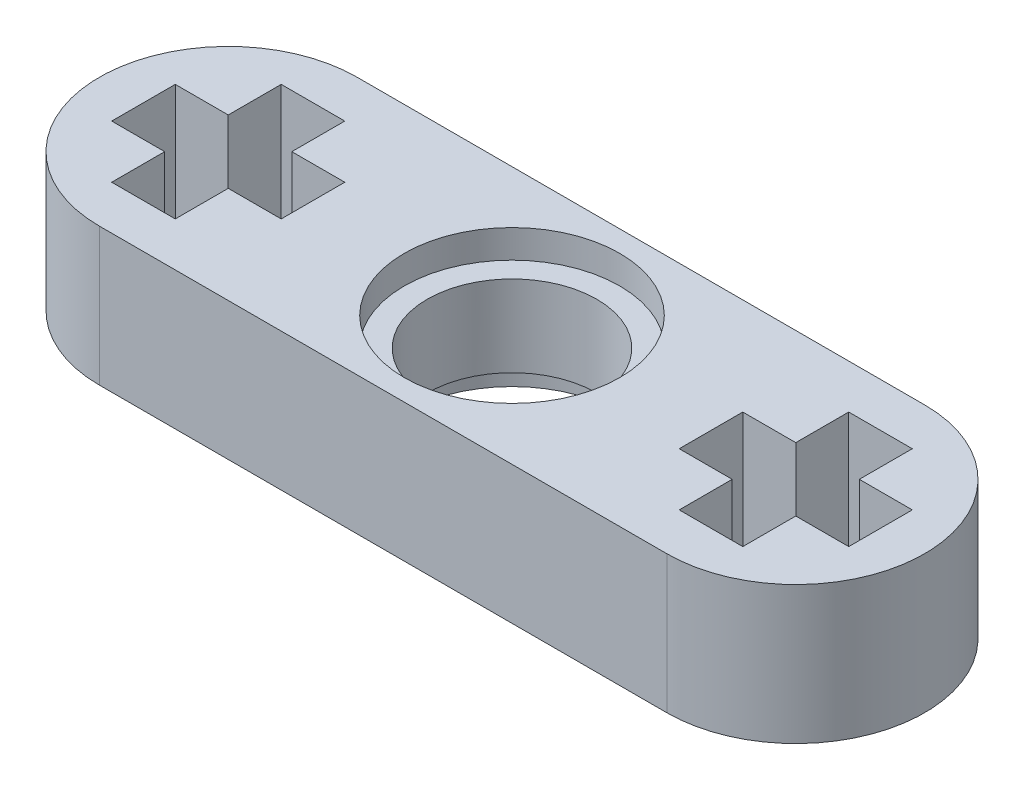
ISO-10303-21;
HEADER;
FILE_DESCRIPTION(('STEP AP214'),'2;1');
FILE_NAME('part.step','',(''),(''),'','','');
FILE_SCHEMA(('AUTOMOTIVE_DESIGN { 1 0 10303 214 1 1 1 1 }'));
ENDSEC;
DATA;
#1=APPLICATION_CONTEXT('core data for automotive mechanical design processes');
#2=APPLICATION_PROTOCOL_DEFINITION('international standard','automotive_design',2000,#1);
#3=PRODUCT_CONTEXT('',#1,'mechanical');
#4=PRODUCT('Part','Part','',(#3));
#5=PRODUCT_RELATED_PRODUCT_CATEGORY('part','',(#4));
#6=PRODUCT_DEFINITION_FORMATION('','',#4);
#7=PRODUCT_DEFINITION_CONTEXT('part definition',#1,'design');
#8=PRODUCT_DEFINITION('design','',#6,#7);
#9=PRODUCT_DEFINITION_SHAPE('','',#8);
#10=(LENGTH_UNIT() NAMED_UNIT(*) SI_UNIT(.MILLI.,.METRE.));
#11=(NAMED_UNIT(*) PLANE_ANGLE_UNIT() SI_UNIT($,.RADIAN.));
#12=(NAMED_UNIT(*) SI_UNIT($,.STERADIAN.) SOLID_ANGLE_UNIT());
#13=UNCERTAINTY_MEASURE_WITH_UNIT(LENGTH_MEASURE(1.E-05),#10,'distance_accuracy_value','');
#14=(GEOMETRIC_REPRESENTATION_CONTEXT(3) GLOBAL_UNCERTAINTY_ASSIGNED_CONTEXT((#13)) GLOBAL_UNIT_ASSIGNED_CONTEXT((#10,
#11,#12)) REPRESENTATION_CONTEXT('',''));
#15=CARTESIAN_POINT('',(0.,0.,0.));
#16=DIRECTION('',(0.,0.,1.));
#17=DIRECTION('',(1.,0.,0.));
#18=AXIS2_PLACEMENT_3D('',#15,#16,#17);
#19=CARTESIAN_POINT('',(0.,3.9,0.));
#20=DIRECTION('',(0.,-1.,0.));
#21=DIRECTION('',(0.,0.,-1.));
#22=AXIS2_PLACEMENT_3D('',#19,#20,#21);
#23=CYLINDRICAL_SURFACE('',#22,2.4);
#24=CARTESIAN_POINT('',(0.,3.1,0.));
#25=DIRECTION('',(0.,1.,0.));
#26=DIRECTION('',(0.,0.,1.));
#27=AXIS2_PLACEMENT_3D('',#24,#25,#26);
#28=CIRCLE('',#27,2.4);
#29=CARTESIAN_POINT('',(0.,3.1,2.4));
#30=VERTEX_POINT('',#29);
#31=EDGE_CURVE('E266',#30,#30,#28,.T.);
#32=ORIENTED_EDGE('',*,*,#31,.T.);
#33=EDGE_LOOP('',(#32));
#34=FACE_BOUND('',#33,.T.);
#35=CARTESIAN_POINT('',(0.,0.8,0.));
#36=DIRECTION('',(0.,-1.,0.));
#37=DIRECTION('',(0.,0.,-1.));
#38=AXIS2_PLACEMENT_3D('',#35,#36,#37);
#39=CIRCLE('',#38,2.4);
#40=CARTESIAN_POINT('',(0.,0.8,-2.4));
#41=VERTEX_POINT('',#40);
#42=EDGE_CURVE('E37',#41,#41,#39,.T.);
#43=ORIENTED_EDGE('',*,*,#42,.T.);
#44=EDGE_LOOP('',(#43));
#45=FACE_BOUND('',#44,.T.);
#46=ADVANCED_FACE('F33',(#34,#45),#23,.F.);
#47=CARTESIAN_POINT('',(-8.035,3.9,0.));
#48=DIRECTION('',(0.,1.,0.));
#49=DIRECTION('',(0.,0.,1.));
#50=AXIS2_PLACEMENT_3D('',#47,#48,#49);
#51=PLANE('',#50);
#52=CARTESIAN_POINT('',(0.,3.9,0.));
#53=DIRECTION('',(0.,1.,0.));
#54=DIRECTION('',(0.,0.,1.));
#55=AXIS2_PLACEMENT_3D('',#52,#53,#54);
#56=CIRCLE('',#55,3.05);
#57=CARTESIAN_POINT('',(0.,3.9,3.05));
#58=VERTEX_POINT('',#57);
#59=EDGE_CURVE('E432',#58,#58,#56,.T.);
#60=ORIENTED_EDGE('',*,*,#59,.F.);
#61=EDGE_LOOP('',(#60));
#62=FACE_BOUND('',#61,.T.);
#63=CARTESIAN_POINT('',(-8.035,3.9,0.));
#64=DIRECTION('',(0.,1.,0.));
#65=DIRECTION('',(0.,0.,1.));
#66=AXIS2_PLACEMENT_3D('',#63,#64,#65);
#67=CIRCLE('',#66,3.65);
#68=CARTESIAN_POINT('',(-8.035,3.9,-3.65));
#69=VERTEX_POINT('',#68);
#70=CARTESIAN_POINT('',(-8.035,3.9,3.65));
#71=VERTEX_POINT('',#70);
#72=EDGE_CURVE('E403',#69,#71,#67,.T.);
#73=ORIENTED_EDGE('',*,*,#72,.T.);
#74=DIRECTION('',(1.,0.,0.));
#75=VECTOR('',#74,1.);
#76=CARTESIAN_POINT('',(-8.035,3.9,3.65));
#77=LINE('',#76,#75);
#78=CARTESIAN_POINT('',(8.035,3.9,3.65));
#79=VERTEX_POINT('',#78);
#80=EDGE_CURVE('E406',#71,#79,#77,.T.);
#81=ORIENTED_EDGE('',*,*,#80,.T.);
#82=CARTESIAN_POINT('',(8.035,3.9,0.));
#83=DIRECTION('',(0.,1.,0.));
#84=DIRECTION('',(0.,0.,1.));
#85=AXIS2_PLACEMENT_3D('',#82,#83,#84);
#86=CIRCLE('',#85,3.65);
#87=CARTESIAN_POINT('',(8.035,3.9,-3.65));
#88=VERTEX_POINT('',#87);
#89=EDGE_CURVE('E409',#79,#88,#86,.T.);
#90=ORIENTED_EDGE('',*,*,#89,.T.);
#91=DIRECTION('',(-1.,0.,0.));
#92=VECTOR('',#91,1.);
#93=CARTESIAN_POINT('',(-8.035,3.9,-3.65));
#94=LINE('',#93,#92);
#95=EDGE_CURVE('E411',#88,#69,#94,.T.);
#96=ORIENTED_EDGE('',*,*,#95,.T.);
#97=EDGE_LOOP('',(#73,#81,#90,#96));
#98=FACE_BOUND('',#97,.T.);
#99=DIRECTION('',(1.,0.,0.));
#100=VECTOR('',#99,1.);
#101=CARTESIAN_POINT('',(10.435,3.9,0.899999999999998));
#102=LINE('',#101,#100);
#103=CARTESIAN_POINT('',(8.935,3.9,0.899999999999998));
#104=VERTEX_POINT('',#103);
#105=CARTESIAN_POINT('',(10.435,3.9,0.899999999999998));
#106=VERTEX_POINT('',#105);
#107=EDGE_CURVE('E318',#104,#106,#102,.T.);
#108=ORIENTED_EDGE('',*,*,#107,.F.);
#109=DIRECTION('',(0.,0.,-1.));
#110=VECTOR('',#109,1.);
#111=CARTESIAN_POINT('',(8.935,3.9,0.899999999999998));
#112=LINE('',#111,#110);
#113=CARTESIAN_POINT('',(8.935,3.9,2.4));
#114=VERTEX_POINT('',#113);
#115=EDGE_CURVE('E316',#114,#104,#112,.T.);
#116=ORIENTED_EDGE('',*,*,#115,.F.);
#117=DIRECTION('',(1.,0.,0.));
#118=VECTOR('',#117,1.);
#119=CARTESIAN_POINT('',(7.135,3.9,2.4));
#120=LINE('',#119,#118);
#121=CARTESIAN_POINT('',(7.135,3.9,2.4));
#122=VERTEX_POINT('',#121);
#123=EDGE_CURVE('E340',#122,#114,#120,.T.);
#124=ORIENTED_EDGE('',*,*,#123,.F.);
#125=DIRECTION('',(0.,0.,1.));
#126=VECTOR('',#125,1.);
#127=CARTESIAN_POINT('',(7.135,3.9,0.899999999999999));
#128=LINE('',#127,#126);
#129=CARTESIAN_POINT('',(7.135,3.9,0.899999999999999));
#130=VERTEX_POINT('',#129);
#131=EDGE_CURVE('E337',#130,#122,#128,.T.);
#132=ORIENTED_EDGE('',*,*,#131,.F.);
#133=DIRECTION('',(1.,0.,0.));
#134=VECTOR('',#133,1.);
#135=CARTESIAN_POINT('',(7.135,3.9,0.899999999999999));
#136=LINE('',#135,#134);
#137=CARTESIAN_POINT('',(5.635,3.9,0.899999999999999));
#138=VERTEX_POINT('',#137);
#139=EDGE_CURVE('E335',#138,#130,#136,.T.);
#140=ORIENTED_EDGE('',*,*,#139,.F.);
#141=DIRECTION('',(0.,0.,1.));
#142=VECTOR('',#141,1.);
#143=CARTESIAN_POINT('',(5.635,3.9,0.899999999999999));
#144=LINE('',#143,#142);
#145=CARTESIAN_POINT('',(5.63500000000001,3.9,-0.899999999999998));
#146=VERTEX_POINT('',#145);
#147=EDGE_CURVE('E333',#146,#138,#144,.T.);
#148=ORIENTED_EDGE('',*,*,#147,.F.);
#149=DIRECTION('',(-1.,0.,0.));
#150=VECTOR('',#149,1.);
#151=CARTESIAN_POINT('',(7.135,3.9,-0.899999999999999));
#152=LINE('',#151,#150);
#153=CARTESIAN_POINT('',(7.135,3.9,-0.899999999999999));
#154=VERTEX_POINT('',#153);
#155=EDGE_CURVE('E331',#154,#146,#152,.T.);
#156=ORIENTED_EDGE('',*,*,#155,.F.);
#157=DIRECTION('',(0.,0.,1.));
#158=VECTOR('',#157,1.);
#159=CARTESIAN_POINT('',(7.135,3.9,-2.4));
#160=LINE('',#159,#158);
#161=CARTESIAN_POINT('',(7.135,3.9,-2.4));
#162=VERTEX_POINT('',#161);
#163=EDGE_CURVE('E329',#162,#154,#160,.T.);
#164=ORIENTED_EDGE('',*,*,#163,.F.);
#165=DIRECTION('',(-1.,0.,0.));
#166=VECTOR('',#165,1.);
#167=CARTESIAN_POINT('',(7.135,3.9,-2.4));
#168=LINE('',#167,#166);
#169=CARTESIAN_POINT('',(8.935,3.9,-2.4));
#170=VERTEX_POINT('',#169);
#171=EDGE_CURVE('E327',#170,#162,#168,.T.);
#172=ORIENTED_EDGE('',*,*,#171,.F.);
#173=DIRECTION('',(0.,0.,-1.));
#174=VECTOR('',#173,1.);
#175=CARTESIAN_POINT('',(8.935,3.9,-2.4));
#176=LINE('',#175,#174);
#177=CARTESIAN_POINT('',(8.935,3.9,-0.900000000000001));
#178=VERTEX_POINT('',#177);
#179=EDGE_CURVE('E325',#178,#170,#176,.T.);
#180=ORIENTED_EDGE('',*,*,#179,.F.);
#181=DIRECTION('',(-1.,0.,0.));
#182=VECTOR('',#181,1.);
#183=CARTESIAN_POINT('',(10.435,3.9,-0.900000000000002));
#184=LINE('',#183,#182);
#185=CARTESIAN_POINT('',(10.435,3.9,-0.900000000000002));
#186=VERTEX_POINT('',#185);
#187=EDGE_CURVE('E323',#186,#178,#184,.T.);
#188=ORIENTED_EDGE('',*,*,#187,.F.);
#189=DIRECTION('',(0.,0.,-1.));
#190=VECTOR('',#189,1.);
#191=CARTESIAN_POINT('',(10.435,3.9,0.899999999999998));
#192=LINE('',#191,#190);
#193=EDGE_CURVE('E321',#106,#186,#192,.T.);
#194=ORIENTED_EDGE('',*,*,#193,.F.);
#195=EDGE_LOOP('',(#108,#116,#124,#132,#140,#148,#156,#164,#172,#180,#188,#194));
#196=FACE_BOUND('',#195,.T.);
#197=DIRECTION('',(1.,0.,0.));
#198=VECTOR('',#197,1.);
#199=CARTESIAN_POINT('',(-5.63495851707108,3.9,0.899893705918284));
#200=LINE('',#199,#198);
#201=CARTESIAN_POINT('',(-7.13495851707083,3.9,0.899893705918284));
#202=VERTEX_POINT('',#201);
#203=CARTESIAN_POINT('',(-5.63495851707108,3.9,0.899893705918284));
#204=VERTEX_POINT('',#203);
#205=EDGE_CURVE('E228',#202,#204,#200,.T.);
#206=ORIENTED_EDGE('',*,*,#205,.F.);
#207=DIRECTION('',(0.,0.,-1.));
#208=VECTOR('',#207,1.);
#209=CARTESIAN_POINT('',(-7.13495851707083,3.9,0.899893705918284));
#210=LINE('',#209,#208);
#211=CARTESIAN_POINT('',(-7.13495851707083,3.9,2.39989370592414));
#212=VERTEX_POINT('',#211);
#213=EDGE_CURVE('E220',#212,#202,#210,.T.);
#214=ORIENTED_EDGE('',*,*,#213,.F.);
#215=DIRECTION('',(1.,0.,0.));
#216=VECTOR('',#215,1.);
#217=CARTESIAN_POINT('',(-8.93495851707108,3.9,2.39989370592414));
#218=LINE('',#217,#216);
#219=CARTESIAN_POINT('',(-8.93495851707108,3.9,2.39989370592414));
#220=VERTEX_POINT('',#219);
#221=EDGE_CURVE('E263',#220,#212,#218,.T.);
#222=ORIENTED_EDGE('',*,*,#221,.F.);
#223=DIRECTION('',(0.,0.,1.));
#224=VECTOR('',#223,1.);
#225=CARTESIAN_POINT('',(-8.93495851707108,3.9,0.899893705918285));
#226=LINE('',#225,#224);
#227=CARTESIAN_POINT('',(-8.93495851707108,3.9,0.899893705918285));
#228=VERTEX_POINT('',#227);
#229=EDGE_CURVE('E261',#228,#220,#226,.T.);
#230=ORIENTED_EDGE('',*,*,#229,.F.);
#231=DIRECTION('',(1.,0.,0.));
#232=VECTOR('',#231,1.);
#233=CARTESIAN_POINT('',(-8.93495851707108,3.9,0.899893705918285));
#234=LINE('',#233,#232);
#235=CARTESIAN_POINT('',(-10.4349585170711,3.9,0.899893705918285));
#236=VERTEX_POINT('',#235);
#237=EDGE_CURVE('E259',#236,#228,#234,.T.);
#238=ORIENTED_EDGE('',*,*,#237,.F.);
#239=DIRECTION('',(0.,0.,1.));
#240=VECTOR('',#239,1.);
#241=CARTESIAN_POINT('',(-10.4349585170711,3.9,0.899893705918285));
#242=LINE('',#241,#240);
#243=CARTESIAN_POINT('',(-10.4349585170711,3.9,-0.900106294081966));
#244=VERTEX_POINT('',#243);
#245=EDGE_CURVE('E257',#244,#236,#242,.T.);
#246=ORIENTED_EDGE('',*,*,#245,.F.);
#247=DIRECTION('',(-1.,0.,0.));
#248=VECTOR('',#247,1.);
#249=CARTESIAN_POINT('',(-8.93495851707108,3.9,-0.900106294081967));
#250=LINE('',#249,#248);
#251=CARTESIAN_POINT('',(-8.93495851707108,3.9,-0.900106294081967));
#252=VERTEX_POINT('',#251);
#253=EDGE_CURVE('E255',#252,#244,#250,.T.);
#254=ORIENTED_EDGE('',*,*,#253,.F.);
#255=DIRECTION('',(0.,0.,1.));
#256=VECTOR('',#255,1.);
#257=CARTESIAN_POINT('',(-8.93495851707108,3.9,-2.40010629407583));
#258=LINE('',#257,#256);
#259=CARTESIAN_POINT('',(-8.93495851707108,3.9,-2.40010629407583));
#260=VERTEX_POINT('',#259);
#261=EDGE_CURVE('E253',#260,#252,#258,.T.);
#262=ORIENTED_EDGE('',*,*,#261,.F.);
#263=DIRECTION('',(-1.,0.,0.));
#264=VECTOR('',#263,1.);
#265=CARTESIAN_POINT('',(-8.93495851707108,3.9,-2.40010629407583));
#266=LINE('',#265,#264);
#267=CARTESIAN_POINT('',(-7.13495851707083,3.9,-2.40010629407583));
#268=VERTEX_POINT('',#267);
#269=EDGE_CURVE('E251',#268,#260,#266,.T.);
#270=ORIENTED_EDGE('',*,*,#269,.F.);
#271=DIRECTION('',(0.,0.,-1.));
#272=VECTOR('',#271,1.);
#273=CARTESIAN_POINT('',(-7.13495851707083,3.9,-2.40010629407583));
#274=LINE('',#273,#272);
#275=CARTESIAN_POINT('',(-7.13495851707083,3.9,-0.900106294081968));
#276=VERTEX_POINT('',#275);
#277=EDGE_CURVE('E249',#276,#268,#274,.T.);
#278=ORIENTED_EDGE('',*,*,#277,.F.);
#279=DIRECTION('',(-1.,0.,0.));
#280=VECTOR('',#279,1.);
#281=CARTESIAN_POINT('',(-5.63495851707109,3.9,-0.900106294081967));
#282=LINE('',#281,#280);
#283=CARTESIAN_POINT('',(-5.63495851707109,3.9,-0.900106294081967));
#284=VERTEX_POINT('',#283);
#285=EDGE_CURVE('E244',#284,#276,#282,.T.);
#286=ORIENTED_EDGE('',*,*,#285,.F.);
#287=DIRECTION('',(0.,0.,-1.));
#288=VECTOR('',#287,1.);
#289=CARTESIAN_POINT('',(-5.63495851707108,3.9,0.899893705918284));
#290=LINE('',#289,#288);
#291=EDGE_CURVE('E242',#204,#284,#290,.T.);
#292=ORIENTED_EDGE('',*,*,#291,.F.);
#293=EDGE_LOOP('',(#206,#214,#222,#230,#238,#246,#254,#262,#270,#278,#286,#292));
#294=FACE_BOUND('',#293,.T.);
#295=ADVANCED_FACE('F240',(#62,#98,#196,#294),#51,.T.);
#296=CARTESIAN_POINT('',(-8.035,0.,0.));
#297=DIRECTION('',(0.,1.,0.));
#298=DIRECTION('',(0.,0.,1.));
#299=AXIS2_PLACEMENT_3D('',#296,#297,#298);
#300=PLANE('',#299);
#301=CARTESIAN_POINT('',(0.,0.,0.));
#302=DIRECTION('',(0.,-1.,0.));
#303=DIRECTION('',(0.,0.,-1.));
#304=AXIS2_PLACEMENT_3D('',#301,#302,#303);
#305=CIRCLE('',#304,3.05);
#306=CARTESIAN_POINT('',(0.,0.,-3.05));
#307=VERTEX_POINT('',#306);
#308=EDGE_CURVE('E438',#307,#307,#305,.T.);
#309=ORIENTED_EDGE('',*,*,#308,.F.);
#310=EDGE_LOOP('',(#309));
#311=FACE_BOUND('',#310,.T.);
#312=DIRECTION('',(0.,0.,-1.));
#313=VECTOR('',#312,1.);
#314=CARTESIAN_POINT('',(8.935,0.,0.899999999999998));
#315=LINE('',#314,#313);
#316=CARTESIAN_POINT('',(8.935,0.,2.4));
#317=VERTEX_POINT('',#316);
#318=CARTESIAN_POINT('',(8.935,0.,0.899999999999998));
#319=VERTEX_POINT('',#318);
#320=EDGE_CURVE('E236',#317,#319,#315,.T.);
#321=ORIENTED_EDGE('',*,*,#320,.T.);
#322=DIRECTION('',(1.,0.,0.));
#323=VECTOR('',#322,1.);
#324=CARTESIAN_POINT('',(10.435,0.,0.899999999999998));
#325=LINE('',#324,#323);
#326=CARTESIAN_POINT('',(10.435,0.,0.899999999999998));
#327=VERTEX_POINT('',#326);
#328=EDGE_CURVE('E345',#319,#327,#325,.T.);
#329=ORIENTED_EDGE('',*,*,#328,.T.);
#330=DIRECTION('',(0.,0.,-1.));
#331=VECTOR('',#330,1.);
#332=CARTESIAN_POINT('',(10.435,0.,0.899999999999998));
#333=LINE('',#332,#331);
#334=CARTESIAN_POINT('',(10.435,0.,-0.900000000000002));
#335=VERTEX_POINT('',#334);
#336=EDGE_CURVE('E348',#327,#335,#333,.T.);
#337=ORIENTED_EDGE('',*,*,#336,.T.);
#338=DIRECTION('',(-1.,0.,0.));
#339=VECTOR('',#338,1.);
#340=CARTESIAN_POINT('',(10.435,0.,-0.900000000000002));
#341=LINE('',#340,#339);
#342=CARTESIAN_POINT('',(8.935,0.,-0.900000000000001));
#343=VERTEX_POINT('',#342);
#344=EDGE_CURVE('E351',#335,#343,#341,.T.);
#345=ORIENTED_EDGE('',*,*,#344,.T.);
#346=DIRECTION('',(0.,0.,-1.));
#347=VECTOR('',#346,1.);
#348=CARTESIAN_POINT('',(8.935,0.,-2.4));
#349=LINE('',#348,#347);
#350=CARTESIAN_POINT('',(8.935,0.,-2.4));
#351=VERTEX_POINT('',#350);
#352=EDGE_CURVE('E354',#343,#351,#349,.T.);
#353=ORIENTED_EDGE('',*,*,#352,.T.);
#354=DIRECTION('',(-1.,0.,0.));
#355=VECTOR('',#354,1.);
#356=CARTESIAN_POINT('',(7.135,0.,-2.4));
#357=LINE('',#356,#355);
#358=CARTESIAN_POINT('',(7.135,0.,-2.4));
#359=VERTEX_POINT('',#358);
#360=EDGE_CURVE('E357',#351,#359,#357,.T.);
#361=ORIENTED_EDGE('',*,*,#360,.T.);
#362=DIRECTION('',(0.,0.,1.));
#363=VECTOR('',#362,1.);
#364=CARTESIAN_POINT('',(7.135,0.,-2.4));
#365=LINE('',#364,#363);
#366=CARTESIAN_POINT('',(7.135,0.,-0.899999999999999));
#367=VERTEX_POINT('',#366);
#368=EDGE_CURVE('E360',#359,#367,#365,.T.);
#369=ORIENTED_EDGE('',*,*,#368,.T.);
#370=DIRECTION('',(-1.,0.,0.));
#371=VECTOR('',#370,1.);
#372=CARTESIAN_POINT('',(7.135,0.,-0.899999999999999));
#373=LINE('',#372,#371);
#374=CARTESIAN_POINT('',(5.63500000000001,0.,-0.899999999999998));
#375=VERTEX_POINT('',#374);
#376=EDGE_CURVE('E363',#367,#375,#373,.T.);
#377=ORIENTED_EDGE('',*,*,#376,.T.);
#378=DIRECTION('',(0.,0.,1.));
#379=VECTOR('',#378,1.);
#380=CARTESIAN_POINT('',(5.635,0.,0.899999999999999));
#381=LINE('',#380,#379);
#382=CARTESIAN_POINT('',(5.635,0.,0.899999999999999));
#383=VERTEX_POINT('',#382);
#384=EDGE_CURVE('E366',#375,#383,#381,.T.);
#385=ORIENTED_EDGE('',*,*,#384,.T.);
#386=DIRECTION('',(1.,0.,0.));
#387=VECTOR('',#386,1.);
#388=CARTESIAN_POINT('',(7.135,0.,0.899999999999999));
#389=LINE('',#388,#387);
#390=CARTESIAN_POINT('',(7.135,0.,0.899999999999999));
#391=VERTEX_POINT('',#390);
#392=EDGE_CURVE('E369',#383,#391,#389,.T.);
#393=ORIENTED_EDGE('',*,*,#392,.T.);
#394=DIRECTION('',(0.,0.,1.));
#395=VECTOR('',#394,1.);
#396=CARTESIAN_POINT('',(7.135,0.,0.899999999999999));
#397=LINE('',#396,#395);
#398=CARTESIAN_POINT('',(7.135,0.,2.4));
#399=VERTEX_POINT('',#398);
#400=EDGE_CURVE('E372',#391,#399,#397,.T.);
#401=ORIENTED_EDGE('',*,*,#400,.T.);
#402=DIRECTION('',(1.,0.,0.));
#403=VECTOR('',#402,1.);
#404=CARTESIAN_POINT('',(7.135,0.,2.4));
#405=LINE('',#404,#403);
#406=EDGE_CURVE('E319',#399,#317,#405,.T.);
#407=ORIENTED_EDGE('',*,*,#406,.T.);
#408=EDGE_LOOP('',(#321,#329,#337,#345,#353,#361,#369,#377,#385,#393,#401,#407));
#409=FACE_BOUND('',#408,.T.);
#410=CARTESIAN_POINT('',(-8.035,0.,0.));
#411=DIRECTION('',(0.,1.,0.));
#412=DIRECTION('',(0.,0.,1.));
#413=AXIS2_PLACEMENT_3D('',#410,#411,#412);
#414=CIRCLE('',#413,3.65);
#415=CARTESIAN_POINT('',(-8.035,0.,-3.65));
#416=VERTEX_POINT('',#415);
#417=CARTESIAN_POINT('',(-8.035,0.,3.65));
#418=VERTEX_POINT('',#417);
#419=EDGE_CURVE('E402',#416,#418,#414,.T.);
#420=ORIENTED_EDGE('',*,*,#419,.F.);
#421=DIRECTION('',(-1.,0.,0.));
#422=VECTOR('',#421,1.);
#423=CARTESIAN_POINT('',(-8.035,0.,-3.65));
#424=LINE('',#423,#422);
#425=CARTESIAN_POINT('',(8.035,0.,-3.65));
#426=VERTEX_POINT('',#425);
#427=EDGE_CURVE('E407',#426,#416,#424,.T.);
#428=ORIENTED_EDGE('',*,*,#427,.F.);
#429=CARTESIAN_POINT('',(8.035,0.,0.));
#430=DIRECTION('',(0.,1.,0.));
#431=DIRECTION('',(0.,0.,1.));
#432=AXIS2_PLACEMENT_3D('',#429,#430,#431);
#433=CIRCLE('',#432,3.65);
#434=CARTESIAN_POINT('',(8.035,0.,3.65));
#435=VERTEX_POINT('',#434);
#436=EDGE_CURVE('E418',#435,#426,#433,.T.);
#437=ORIENTED_EDGE('',*,*,#436,.F.);
#438=DIRECTION('',(1.,0.,0.));
#439=VECTOR('',#438,1.);
#440=CARTESIAN_POINT('',(-8.035,0.,3.65));
#441=LINE('',#440,#439);
#442=EDGE_CURVE('E416',#418,#435,#441,.T.);
#443=ORIENTED_EDGE('',*,*,#442,.F.);
#444=EDGE_LOOP('',(#420,#428,#437,#443));
#445=FACE_BOUND('',#444,.T.);
#446=DIRECTION('',(0.,0.,-1.));
#447=VECTOR('',#446,1.);
#448=CARTESIAN_POINT('',(-7.13495851707083,0.,0.899893705918284));
#449=LINE('',#448,#447);
#450=CARTESIAN_POINT('',(-7.13495851707083,0.,2.39989370592414));
#451=VERTEX_POINT('',#450);
#452=CARTESIAN_POINT('',(-7.13495851707083,0.,0.899893705918284));
#453=VERTEX_POINT('',#452);
#454=EDGE_CURVE('E58',#451,#453,#449,.T.);
#455=ORIENTED_EDGE('',*,*,#454,.T.);
#456=DIRECTION('',(1.,0.,0.));
#457=VECTOR('',#456,1.);
#458=CARTESIAN_POINT('',(-5.63495851707108,0.,0.899893705918284));
#459=LINE('',#458,#457);
#460=CARTESIAN_POINT('',(-5.63495851707108,0.,0.899893705918284));
#461=VERTEX_POINT('',#460);
#462=EDGE_CURVE('E235',#453,#461,#459,.T.);
#463=ORIENTED_EDGE('',*,*,#462,.T.);
#464=DIRECTION('',(0.,0.,-1.));
#465=VECTOR('',#464,1.);
#466=CARTESIAN_POINT('',(-5.63495851707108,0.,0.899893705918284));
#467=LINE('',#466,#465);
#468=CARTESIAN_POINT('',(-5.63495851707109,0.,-0.900106294081967));
#469=VERTEX_POINT('',#468);
#470=EDGE_CURVE('E268',#461,#469,#467,.T.);
#471=ORIENTED_EDGE('',*,*,#470,.T.);
#472=DIRECTION('',(-1.,0.,0.));
#473=VECTOR('',#472,1.);
#474=CARTESIAN_POINT('',(-5.63495851707109,0.,-0.900106294081967));
#475=LINE('',#474,#473);
#476=CARTESIAN_POINT('',(-7.13495851707083,0.,-0.900106294081968));
#477=VERTEX_POINT('',#476);
#478=EDGE_CURVE('E271',#469,#477,#475,.T.);
#479=ORIENTED_EDGE('',*,*,#478,.T.);
#480=DIRECTION('',(0.,0.,-1.));
#481=VECTOR('',#480,1.);
#482=CARTESIAN_POINT('',(-7.13495851707083,0.,-2.40010629407583));
#483=LINE('',#482,#481);
#484=CARTESIAN_POINT('',(-7.13495851707083,0.,-2.40010629407583));
#485=VERTEX_POINT('',#484);
#486=EDGE_CURVE('E274',#477,#485,#483,.T.);
#487=ORIENTED_EDGE('',*,*,#486,.T.);
#488=DIRECTION('',(-1.,0.,0.));
#489=VECTOR('',#488,1.);
#490=CARTESIAN_POINT('',(-8.93495851707108,0.,-2.40010629407583));
#491=LINE('',#490,#489);
#492=CARTESIAN_POINT('',(-8.93495851707108,0.,-2.40010629407583));
#493=VERTEX_POINT('',#492);
#494=EDGE_CURVE('E277',#485,#493,#491,.T.);
#495=ORIENTED_EDGE('',*,*,#494,.T.);
#496=DIRECTION('',(0.,0.,1.));
#497=VECTOR('',#496,1.);
#498=CARTESIAN_POINT('',(-8.93495851707108,0.,-2.40010629407583));
#499=LINE('',#498,#497);
#500=CARTESIAN_POINT('',(-8.93495851707108,0.,-0.900106294081967));
#501=VERTEX_POINT('',#500);
#502=EDGE_CURVE('E280',#493,#501,#499,.T.);
#503=ORIENTED_EDGE('',*,*,#502,.T.);
#504=DIRECTION('',(-1.,0.,0.));
#505=VECTOR('',#504,1.);
#506=CARTESIAN_POINT('',(-8.93495851707108,0.,-0.900106294081967));
#507=LINE('',#506,#505);
#508=CARTESIAN_POINT('',(-10.4349585170711,0.,-0.900106294081966));
#509=VERTEX_POINT('',#508);
#510=EDGE_CURVE('E283',#501,#509,#507,.T.);
#511=ORIENTED_EDGE('',*,*,#510,.T.);
#512=DIRECTION('',(0.,0.,1.));
#513=VECTOR('',#512,1.);
#514=CARTESIAN_POINT('',(-10.4349585170711,0.,0.899893705918285));
#515=LINE('',#514,#513);
#516=CARTESIAN_POINT('',(-10.4349585170711,0.,0.899893705918285));
#517=VERTEX_POINT('',#516);
#518=EDGE_CURVE('E286',#509,#517,#515,.T.);
#519=ORIENTED_EDGE('',*,*,#518,.T.);
#520=DIRECTION('',(1.,0.,0.));
#521=VECTOR('',#520,1.);
#522=CARTESIAN_POINT('',(-8.93495851707108,0.,0.899893705918285));
#523=LINE('',#522,#521);
#524=CARTESIAN_POINT('',(-8.93495851707108,0.,0.899893705918285));
#525=VERTEX_POINT('',#524);
#526=EDGE_CURVE('E289',#517,#525,#523,.T.);
#527=ORIENTED_EDGE('',*,*,#526,.T.);
#528=DIRECTION('',(0.,0.,1.));
#529=VECTOR('',#528,1.);
#530=CARTESIAN_POINT('',(-8.93495851707108,0.,0.899893705918285));
#531=LINE('',#530,#529);
#532=CARTESIAN_POINT('',(-8.93495851707108,0.,2.39989370592414));
#533=VERTEX_POINT('',#532);
#534=EDGE_CURVE('E292',#525,#533,#531,.T.);
#535=ORIENTED_EDGE('',*,*,#534,.T.);
#536=DIRECTION('',(1.,0.,0.));
#537=VECTOR('',#536,1.);
#538=CARTESIAN_POINT('',(-8.93495851707108,0.,2.39989370592414));
#539=LINE('',#538,#537);
#540=EDGE_CURVE('E229',#533,#451,#539,.T.);
#541=ORIENTED_EDGE('',*,*,#540,.T.);
#542=EDGE_LOOP('',(#455,#463,#471,#479,#487,#495,#503,#511,#519,#527,#535,#541));
#543=FACE_BOUND('',#542,.T.);
#544=ADVANCED_FACE('F466',(#311,#409,#445,#543),#300,.F.);
#545=CARTESIAN_POINT('',(-8.035,3.9,0.));
#546=DIRECTION('',(0.,-1.,0.));
#547=DIRECTION('',(0.,0.,-1.));
#548=AXIS2_PLACEMENT_3D('',#545,#546,#547);
#549=CYLINDRICAL_SURFACE('',#548,3.65);
#550=ORIENTED_EDGE('',*,*,#419,.T.);
#551=DIRECTION('',(0.,-1.,0.));
#552=VECTOR('',#551,1.);
#553=CARTESIAN_POINT('',(-8.035,3.9,3.65));
#554=LINE('',#553,#552);
#555=EDGE_CURVE('E11',#71,#418,#554,.T.);
#556=ORIENTED_EDGE('',*,*,#555,.F.);
#557=ORIENTED_EDGE('',*,*,#72,.F.);
#558=DIRECTION('',(0.,-1.,0.));
#559=VECTOR('',#558,1.);
#560=CARTESIAN_POINT('',(-8.035,3.9,-3.65));
#561=LINE('',#560,#559);
#562=EDGE_CURVE('E413',#69,#416,#561,.T.);
#563=ORIENTED_EDGE('',*,*,#562,.T.);
#564=EDGE_LOOP('',(#550,#556,#557,#563));
#565=FACE_BOUND('',#564,.T.);
#566=ADVANCED_FACE('F35',(#565),#549,.T.);
#567=CARTESIAN_POINT('',(-8.035,3.9,3.65));
#568=DIRECTION('',(0.,0.,-1.));
#569=DIRECTION('',(-1.,0.,0.));
#570=AXIS2_PLACEMENT_3D('',#567,#568,#569);
#571=PLANE('',#570);
#572=ORIENTED_EDGE('',*,*,#442,.T.);
#573=DIRECTION('',(0.,-1.,0.));
#574=VECTOR('',#573,1.);
#575=CARTESIAN_POINT('',(8.035,3.9,3.65));
#576=LINE('',#575,#574);
#577=EDGE_CURVE('E42',#79,#435,#576,.T.);
#578=ORIENTED_EDGE('',*,*,#577,.F.);
#579=ORIENTED_EDGE('',*,*,#80,.F.);
#580=ORIENTED_EDGE('',*,*,#555,.T.);
#581=EDGE_LOOP('',(#572,#578,#579,#580));
#582=FACE_BOUND('',#581,.T.);
#583=ADVANCED_FACE('F481',(#582),#571,.F.);
#584=CARTESIAN_POINT('',(8.035,3.9,0.));
#585=DIRECTION('',(0.,-1.,0.));
#586=DIRECTION('',(0.,0.,-1.));
#587=AXIS2_PLACEMENT_3D('',#584,#585,#586);
#588=CYLINDRICAL_SURFACE('',#587,3.65);
#589=ORIENTED_EDGE('',*,*,#436,.T.);
#590=DIRECTION('',(0.,-1.,0.));
#591=VECTOR('',#590,1.);
#592=CARTESIAN_POINT('',(8.035,3.9,-3.65));
#593=LINE('',#592,#591);
#594=EDGE_CURVE('E423',#88,#426,#593,.T.);
#595=ORIENTED_EDGE('',*,*,#594,.F.);
#596=ORIENTED_EDGE('',*,*,#89,.F.);
#597=ORIENTED_EDGE('',*,*,#577,.T.);
#598=EDGE_LOOP('',(#589,#595,#596,#597));
#599=FACE_BOUND('',#598,.T.);
#600=ADVANCED_FACE('F478',(#599),#588,.T.);
#601=CARTESIAN_POINT('',(-8.035,3.9,-3.65));
#602=DIRECTION('',(0.,0.,1.));
#603=DIRECTION('',(1.,0.,0.));
#604=AXIS2_PLACEMENT_3D('',#601,#602,#603);
#605=PLANE('',#604);
#606=ORIENTED_EDGE('',*,*,#427,.T.);
#607=ORIENTED_EDGE('',*,*,#562,.F.);
#608=ORIENTED_EDGE('',*,*,#95,.F.);
#609=ORIENTED_EDGE('',*,*,#594,.T.);
#610=EDGE_LOOP('',(#606,#607,#608,#609));
#611=FACE_BOUND('',#610,.T.);
#612=ADVANCED_FACE('F475',(#611),#605,.F.);
#613=CARTESIAN_POINT('',(8.935,3.9,0.899999999999998));
#614=DIRECTION('',(-1.,0.,0.));
#615=DIRECTION('',(0.,0.,1.));
#616=AXIS2_PLACEMENT_3D('',#613,#614,#615);
#617=PLANE('',#616);
#618=ORIENTED_EDGE('',*,*,#320,.F.);
#619=DIRECTION('',(0.,-1.,0.));
#620=VECTOR('',#619,1.);
#621=CARTESIAN_POINT('',(8.935,3.9,2.4));
#622=LINE('',#621,#620);
#623=EDGE_CURVE('E342',#114,#317,#622,.T.);
#624=ORIENTED_EDGE('',*,*,#623,.F.);
#625=ORIENTED_EDGE('',*,*,#115,.T.);
#626=DIRECTION('',(0.,-1.,0.));
#627=VECTOR('',#626,1.);
#628=CARTESIAN_POINT('',(8.935,3.9,0.899999999999998));
#629=LINE('',#628,#627);
#630=EDGE_CURVE('E399',#104,#319,#629,.T.);
#631=ORIENTED_EDGE('',*,*,#630,.T.);
#632=EDGE_LOOP('',(#618,#624,#625,#631));
#633=FACE_BOUND('',#632,.T.);
#634=ADVANCED_FACE('F470',(#633),#617,.T.);
#635=CARTESIAN_POINT('',(10.435,3.9,0.899999999999998));
#636=DIRECTION('',(0.,0.,-1.));
#637=DIRECTION('',(-1.,0.,0.));
#638=AXIS2_PLACEMENT_3D('',#635,#636,#637);
#639=PLANE('',#638);
#640=ORIENTED_EDGE('',*,*,#328,.F.);
#641=ORIENTED_EDGE('',*,*,#630,.F.);
#642=ORIENTED_EDGE('',*,*,#107,.T.);
#643=DIRECTION('',(0.,-1.,0.));
#644=VECTOR('',#643,1.);
#645=CARTESIAN_POINT('',(10.435,3.9,0.899999999999998));
#646=LINE('',#645,#644);
#647=EDGE_CURVE('E397',#106,#327,#646,.T.);
#648=ORIENTED_EDGE('',*,*,#647,.T.);
#649=EDGE_LOOP('',(#640,#641,#642,#648));
#650=FACE_BOUND('',#649,.T.);
#651=ADVANCED_FACE('F511',(#650),#639,.T.);
#652=CARTESIAN_POINT('',(10.435,3.9,0.899999999999998));
#653=DIRECTION('',(-1.,0.,0.));
#654=DIRECTION('',(0.,0.,1.));
#655=AXIS2_PLACEMENT_3D('',#652,#653,#654);
#656=PLANE('',#655);
#657=ORIENTED_EDGE('',*,*,#336,.F.);
#658=ORIENTED_EDGE('',*,*,#647,.F.);
#659=ORIENTED_EDGE('',*,*,#193,.T.);
#660=DIRECTION('',(0.,-1.,0.));
#661=VECTOR('',#660,1.);
#662=CARTESIAN_POINT('',(10.435,3.9,-0.900000000000002));
#663=LINE('',#662,#661);
#664=EDGE_CURVE('E395',#186,#335,#663,.T.);
#665=ORIENTED_EDGE('',*,*,#664,.T.);
#666=EDGE_LOOP('',(#657,#658,#659,#665));
#667=FACE_BOUND('',#666,.T.);
#668=ADVANCED_FACE('F514',(#667),#656,.T.);
#669=CARTESIAN_POINT('',(10.435,3.9,-0.900000000000002));
#670=DIRECTION('',(0.,0.,1.));
#671=DIRECTION('',(1.,0.,0.));
#672=AXIS2_PLACEMENT_3D('',#669,#670,#671);
#673=PLANE('',#672);
#674=ORIENTED_EDGE('',*,*,#344,.F.);
#675=ORIENTED_EDGE('',*,*,#664,.F.);
#676=ORIENTED_EDGE('',*,*,#187,.T.);
#677=DIRECTION('',(0.,-1.,0.));
#678=VECTOR('',#677,1.);
#679=CARTESIAN_POINT('',(8.935,3.9,-0.900000000000001));
#680=LINE('',#679,#678);
#681=EDGE_CURVE('E393',#178,#343,#680,.T.);
#682=ORIENTED_EDGE('',*,*,#681,.T.);
#683=EDGE_LOOP('',(#674,#675,#676,#682));
#684=FACE_BOUND('',#683,.T.);
#685=ADVANCED_FACE('F559',(#684),#673,.T.);
#686=CARTESIAN_POINT('',(8.935,3.9,-2.4));
#687=DIRECTION('',(-1.,0.,0.));
#688=DIRECTION('',(0.,0.,1.));
#689=AXIS2_PLACEMENT_3D('',#686,#687,#688);
#690=PLANE('',#689);
#691=ORIENTED_EDGE('',*,*,#352,.F.);
#692=ORIENTED_EDGE('',*,*,#681,.F.);
#693=ORIENTED_EDGE('',*,*,#179,.T.);
#694=DIRECTION('',(0.,-1.,0.));
#695=VECTOR('',#694,1.);
#696=CARTESIAN_POINT('',(8.935,3.9,-2.4));
#697=LINE('',#696,#695);
#698=EDGE_CURVE('E391',#170,#351,#697,.T.);
#699=ORIENTED_EDGE('',*,*,#698,.T.);
#700=EDGE_LOOP('',(#691,#692,#693,#699));
#701=FACE_BOUND('',#700,.T.);
#702=ADVANCED_FACE('F556',(#701),#690,.T.);
#703=CARTESIAN_POINT('',(7.135,3.9,-2.4));
#704=DIRECTION('',(0.,0.,1.));
#705=DIRECTION('',(1.,0.,0.));
#706=AXIS2_PLACEMENT_3D('',#703,#704,#705);
#707=PLANE('',#706);
#708=ORIENTED_EDGE('',*,*,#360,.F.);
#709=ORIENTED_EDGE('',*,*,#698,.F.);
#710=ORIENTED_EDGE('',*,*,#171,.T.);
#711=DIRECTION('',(0.,-1.,0.));
#712=VECTOR('',#711,1.);
#713=CARTESIAN_POINT('',(7.135,3.9,-2.4));
#714=LINE('',#713,#712);
#715=EDGE_CURVE('E389',#162,#359,#714,.T.);
#716=ORIENTED_EDGE('',*,*,#715,.T.);
#717=EDGE_LOOP('',(#708,#709,#710,#716));
#718=FACE_BOUND('',#717,.T.);
#719=ADVANCED_FACE('F552',(#718),#707,.T.);
#720=CARTESIAN_POINT('',(7.135,3.9,-2.4));
#721=DIRECTION('',(1.,0.,0.));
#722=DIRECTION('',(0.,0.,-1.));
#723=AXIS2_PLACEMENT_3D('',#720,#721,#722);
#724=PLANE('',#723);
#725=ORIENTED_EDGE('',*,*,#368,.F.);
#726=ORIENTED_EDGE('',*,*,#715,.F.);
#727=ORIENTED_EDGE('',*,*,#163,.T.);
#728=DIRECTION('',(0.,-1.,0.));
#729=VECTOR('',#728,1.);
#730=CARTESIAN_POINT('',(7.135,3.9,-0.899999999999999));
#731=LINE('',#730,#729);
#732=EDGE_CURVE('E387',#154,#367,#731,.T.);
#733=ORIENTED_EDGE('',*,*,#732,.T.);
#734=EDGE_LOOP('',(#725,#726,#727,#733));
#735=FACE_BOUND('',#734,.T.);
#736=ADVANCED_FACE('F549',(#735),#724,.T.);
#737=CARTESIAN_POINT('',(7.135,3.9,-0.899999999999999));
#738=DIRECTION('',(0.,0.,1.));
#739=DIRECTION('',(1.,0.,0.));
#740=AXIS2_PLACEMENT_3D('',#737,#738,#739);
#741=PLANE('',#740);
#742=ORIENTED_EDGE('',*,*,#376,.F.);
#743=ORIENTED_EDGE('',*,*,#732,.F.);
#744=ORIENTED_EDGE('',*,*,#155,.T.);
#745=DIRECTION('',(0.,-1.,0.));
#746=VECTOR('',#745,1.);
#747=CARTESIAN_POINT('',(5.63500000000001,3.9,-0.899999999999998));
#748=LINE('',#747,#746);
#749=EDGE_CURVE('E385',#146,#375,#748,.T.);
#750=ORIENTED_EDGE('',*,*,#749,.T.);
#751=EDGE_LOOP('',(#742,#743,#744,#750));
#752=FACE_BOUND('',#751,.T.);
#753=ADVANCED_FACE('F541',(#752),#741,.T.);
#754=CARTESIAN_POINT('',(5.635,3.9,0.899999999999999));
#755=DIRECTION('',(1.,0.,0.));
#756=DIRECTION('',(0.,0.,-1.));
#757=AXIS2_PLACEMENT_3D('',#754,#755,#756);
#758=PLANE('',#757);
#759=ORIENTED_EDGE('',*,*,#384,.F.);
#760=ORIENTED_EDGE('',*,*,#749,.F.);
#761=ORIENTED_EDGE('',*,*,#147,.T.);
#762=DIRECTION('',(0.,-1.,0.));
#763=VECTOR('',#762,1.);
#764=CARTESIAN_POINT('',(5.635,3.9,0.899999999999999));
#765=LINE('',#764,#763);
#766=EDGE_CURVE('E383',#138,#383,#765,.T.);
#767=ORIENTED_EDGE('',*,*,#766,.T.);
#768=EDGE_LOOP('',(#759,#760,#761,#767));
#769=FACE_BOUND('',#768,.T.);
#770=ADVANCED_FACE('F537',(#769),#758,.T.);
#771=CARTESIAN_POINT('',(7.135,3.9,0.899999999999999));
#772=DIRECTION('',(0.,0.,-1.));
#773=DIRECTION('',(-1.,0.,0.));
#774=AXIS2_PLACEMENT_3D('',#771,#772,#773);
#775=PLANE('',#774);
#776=ORIENTED_EDGE('',*,*,#392,.F.);
#777=ORIENTED_EDGE('',*,*,#766,.F.);
#778=ORIENTED_EDGE('',*,*,#139,.T.);
#779=DIRECTION('',(0.,-1.,0.));
#780=VECTOR('',#779,1.);
#781=CARTESIAN_POINT('',(7.135,3.9,0.899999999999999));
#782=LINE('',#781,#780);
#783=EDGE_CURVE('E381',#130,#391,#782,.T.);
#784=ORIENTED_EDGE('',*,*,#783,.T.);
#785=EDGE_LOOP('',(#776,#777,#778,#784));
#786=FACE_BOUND('',#785,.T.);
#787=ADVANCED_FACE('F534',(#786),#775,.T.);
#788=CARTESIAN_POINT('',(7.135,3.9,0.899999999999999));
#789=DIRECTION('',(1.,0.,0.));
#790=DIRECTION('',(0.,0.,-1.));
#791=AXIS2_PLACEMENT_3D('',#788,#789,#790);
#792=PLANE('',#791);
#793=ORIENTED_EDGE('',*,*,#400,.F.);
#794=ORIENTED_EDGE('',*,*,#783,.F.);
#795=ORIENTED_EDGE('',*,*,#131,.T.);
#796=DIRECTION('',(0.,-1.,0.));
#797=VECTOR('',#796,1.);
#798=CARTESIAN_POINT('',(7.135,3.9,2.4));
#799=LINE('',#798,#797);
#800=EDGE_CURVE('E379',#122,#399,#799,.T.);
#801=ORIENTED_EDGE('',*,*,#800,.T.);
#802=EDGE_LOOP('',(#793,#794,#795,#801));
#803=FACE_BOUND('',#802,.T.);
#804=ADVANCED_FACE('F527',(#803),#792,.T.);
#805=CARTESIAN_POINT('',(7.135,3.9,2.4));
#806=DIRECTION('',(0.,0.,-1.));
#807=DIRECTION('',(-1.,0.,0.));
#808=AXIS2_PLACEMENT_3D('',#805,#806,#807);
#809=PLANE('',#808);
#810=ORIENTED_EDGE('',*,*,#406,.F.);
#811=ORIENTED_EDGE('',*,*,#800,.F.);
#812=ORIENTED_EDGE('',*,*,#123,.T.);
#813=ORIENTED_EDGE('',*,*,#623,.T.);
#814=EDGE_LOOP('',(#810,#811,#812,#813));
#815=FACE_BOUND('',#814,.T.);
#816=ADVANCED_FACE('F522',(#815),#809,.T.);
#817=CARTESIAN_POINT('',(-7.13495851707083,3.9,0.899893705918284));
#818=DIRECTION('',(-1.,0.,0.));
#819=DIRECTION('',(0.,0.,1.));
#820=AXIS2_PLACEMENT_3D('',#817,#818,#819);
#821=PLANE('',#820);
#822=ORIENTED_EDGE('',*,*,#454,.F.);
#823=DIRECTION('',(0.,-1.,0.));
#824=VECTOR('',#823,1.);
#825=CARTESIAN_POINT('',(-7.13495851707083,3.9,2.39989370592414));
#826=LINE('',#825,#824);
#827=EDGE_CURVE('E224',#212,#451,#826,.T.);
#828=ORIENTED_EDGE('',*,*,#827,.F.);
#829=ORIENTED_EDGE('',*,*,#213,.T.);
#830=DIRECTION('',(0.,-1.,0.));
#831=VECTOR('',#830,1.);
#832=CARTESIAN_POINT('',(-7.13495851707083,3.9,0.899893705918284));
#833=LINE('',#832,#831);
#834=EDGE_CURVE('E223',#202,#453,#833,.T.);
#835=ORIENTED_EDGE('',*,*,#834,.T.);
#836=EDGE_LOOP('',(#822,#828,#829,#835));
#837=FACE_BOUND('',#836,.T.);
#838=ADVANCED_FACE('F222',(#837),#821,.T.);
#839=CARTESIAN_POINT('',(-5.63495851707108,3.9,0.899893705918284));
#840=DIRECTION('',(0.,0.,-1.));
#841=DIRECTION('',(-1.,0.,0.));
#842=AXIS2_PLACEMENT_3D('',#839,#840,#841);
#843=PLANE('',#842);
#844=ORIENTED_EDGE('',*,*,#462,.F.);
#845=ORIENTED_EDGE('',*,*,#834,.F.);
#846=ORIENTED_EDGE('',*,*,#205,.T.);
#847=DIRECTION('',(0.,-1.,0.));
#848=VECTOR('',#847,1.);
#849=CARTESIAN_POINT('',(-5.63495851707108,3.9,0.899893705918284));
#850=LINE('',#849,#848);
#851=EDGE_CURVE('E237',#204,#461,#850,.T.);
#852=ORIENTED_EDGE('',*,*,#851,.T.);
#853=EDGE_LOOP('',(#844,#845,#846,#852));
#854=FACE_BOUND('',#853,.T.);
#855=ADVANCED_FACE('F232',(#854),#843,.T.);
#856=CARTESIAN_POINT('',(-5.63495851707108,3.9,0.899893705918284));
#857=DIRECTION('',(-1.,0.,0.));
#858=DIRECTION('',(0.,0.,1.));
#859=AXIS2_PLACEMENT_3D('',#856,#857,#858);
#860=PLANE('',#859);
#861=ORIENTED_EDGE('',*,*,#470,.F.);
#862=ORIENTED_EDGE('',*,*,#851,.F.);
#863=ORIENTED_EDGE('',*,*,#291,.T.);
#864=DIRECTION('',(0.,-1.,0.));
#865=VECTOR('',#864,1.);
#866=CARTESIAN_POINT('',(-5.63495851707109,3.9,-0.900106294081967));
#867=LINE('',#866,#865);
#868=EDGE_CURVE('E313',#284,#469,#867,.T.);
#869=ORIENTED_EDGE('',*,*,#868,.T.);
#870=EDGE_LOOP('',(#861,#862,#863,#869));
#871=FACE_BOUND('',#870,.T.);
#872=ADVANCED_FACE('F709',(#871),#860,.T.);
#873=CARTESIAN_POINT('',(-5.63495851707109,3.9,-0.900106294081967));
#874=DIRECTION('',(0.,0.,1.));
#875=DIRECTION('',(1.,0.,0.));
#876=AXIS2_PLACEMENT_3D('',#873,#874,#875);
#877=PLANE('',#876);
#878=ORIENTED_EDGE('',*,*,#478,.F.);
#879=ORIENTED_EDGE('',*,*,#868,.F.);
#880=ORIENTED_EDGE('',*,*,#285,.T.);
#881=DIRECTION('',(0.,-1.,0.));
#882=VECTOR('',#881,1.);
#883=CARTESIAN_POINT('',(-7.13495851707083,3.9,-0.900106294081968));
#884=LINE('',#883,#882);
#885=EDGE_CURVE('E311',#276,#477,#884,.T.);
#886=ORIENTED_EDGE('',*,*,#885,.T.);
#887=EDGE_LOOP('',(#878,#879,#880,#886));
#888=FACE_BOUND('',#887,.T.);
#889=ADVANCED_FACE('F701',(#888),#877,.T.);
#890=CARTESIAN_POINT('',(-7.13495851707083,3.9,-2.40010629407583));
#891=DIRECTION('',(-1.,0.,0.));
#892=DIRECTION('',(0.,0.,1.));
#893=AXIS2_PLACEMENT_3D('',#890,#891,#892);
#894=PLANE('',#893);
#895=ORIENTED_EDGE('',*,*,#486,.F.);
#896=ORIENTED_EDGE('',*,*,#885,.F.);
#897=ORIENTED_EDGE('',*,*,#277,.T.);
#898=DIRECTION('',(0.,-1.,0.));
#899=VECTOR('',#898,1.);
#900=CARTESIAN_POINT('',(-7.13495851707083,3.9,-2.40010629407583));
#901=LINE('',#900,#899);
#902=EDGE_CURVE('E309',#268,#485,#901,.T.);
#903=ORIENTED_EDGE('',*,*,#902,.T.);
#904=EDGE_LOOP('',(#895,#896,#897,#903));
#905=FACE_BOUND('',#904,.T.);
#906=ADVANCED_FACE('F693',(#905),#894,.T.);
#907=CARTESIAN_POINT('',(-8.93495851707108,3.9,-2.40010629407583));
#908=DIRECTION('',(0.,0.,1.));
#909=DIRECTION('',(1.,0.,0.));
#910=AXIS2_PLACEMENT_3D('',#907,#908,#909);
#911=PLANE('',#910);
#912=ORIENTED_EDGE('',*,*,#494,.F.);
#913=ORIENTED_EDGE('',*,*,#902,.F.);
#914=ORIENTED_EDGE('',*,*,#269,.T.);
#915=DIRECTION('',(0.,-1.,0.));
#916=VECTOR('',#915,1.);
#917=CARTESIAN_POINT('',(-8.93495851707108,3.9,-2.40010629407583));
#918=LINE('',#917,#916);
#919=EDGE_CURVE('E307',#260,#493,#918,.T.);
#920=ORIENTED_EDGE('',*,*,#919,.T.);
#921=EDGE_LOOP('',(#912,#913,#914,#920));
#922=FACE_BOUND('',#921,.T.);
#923=ADVANCED_FACE('F685',(#922),#911,.T.);
#924=CARTESIAN_POINT('',(-8.93495851707108,3.9,-2.40010629407583));
#925=DIRECTION('',(1.,0.,0.));
#926=DIRECTION('',(0.,0.,-1.));
#927=AXIS2_PLACEMENT_3D('',#924,#925,#926);
#928=PLANE('',#927);
#929=ORIENTED_EDGE('',*,*,#502,.F.);
#930=ORIENTED_EDGE('',*,*,#919,.F.);
#931=ORIENTED_EDGE('',*,*,#261,.T.);
#932=DIRECTION('',(0.,-1.,0.));
#933=VECTOR('',#932,1.);
#934=CARTESIAN_POINT('',(-8.93495851707108,3.9,-0.900106294081967));
#935=LINE('',#934,#933);
#936=EDGE_CURVE('E305',#252,#501,#935,.T.);
#937=ORIENTED_EDGE('',*,*,#936,.T.);
#938=EDGE_LOOP('',(#929,#930,#931,#937));
#939=FACE_BOUND('',#938,.T.);
#940=ADVANCED_FACE('F677',(#939),#928,.T.);
#941=CARTESIAN_POINT('',(-8.93495851707108,3.9,-0.900106294081967));
#942=DIRECTION('',(0.,0.,1.));
#943=DIRECTION('',(1.,0.,0.));
#944=AXIS2_PLACEMENT_3D('',#941,#942,#943);
#945=PLANE('',#944);
#946=ORIENTED_EDGE('',*,*,#510,.F.);
#947=ORIENTED_EDGE('',*,*,#936,.F.);
#948=ORIENTED_EDGE('',*,*,#253,.T.);
#949=DIRECTION('',(0.,-1.,0.));
#950=VECTOR('',#949,1.);
#951=CARTESIAN_POINT('',(-10.4349585170711,3.9,-0.900106294081966));
#952=LINE('',#951,#950);
#953=EDGE_CURVE('E303',#244,#509,#952,.T.);
#954=ORIENTED_EDGE('',*,*,#953,.T.);
#955=EDGE_LOOP('',(#946,#947,#948,#954));
#956=FACE_BOUND('',#955,.T.);
#957=ADVANCED_FACE('F669',(#956),#945,.T.);
#958=CARTESIAN_POINT('',(-10.4349585170711,3.9,0.899893705918285));
#959=DIRECTION('',(1.,0.,0.));
#960=DIRECTION('',(0.,0.,-1.));
#961=AXIS2_PLACEMENT_3D('',#958,#959,#960);
#962=PLANE('',#961);
#963=ORIENTED_EDGE('',*,*,#518,.F.);
#964=ORIENTED_EDGE('',*,*,#953,.F.);
#965=ORIENTED_EDGE('',*,*,#245,.T.);
#966=DIRECTION('',(0.,-1.,0.));
#967=VECTOR('',#966,1.);
#968=CARTESIAN_POINT('',(-10.4349585170711,3.9,0.899893705918285));
#969=LINE('',#968,#967);
#970=EDGE_CURVE('E301',#236,#517,#969,.T.);
#971=ORIENTED_EDGE('',*,*,#970,.T.);
#972=EDGE_LOOP('',(#963,#964,#965,#971));
#973=FACE_BOUND('',#972,.T.);
#974=ADVANCED_FACE('F661',(#973),#962,.T.);
#975=CARTESIAN_POINT('',(-8.93495851707108,3.9,0.899893705918285));
#976=DIRECTION('',(0.,0.,-1.));
#977=DIRECTION('',(-1.,0.,0.));
#978=AXIS2_PLACEMENT_3D('',#975,#976,#977);
#979=PLANE('',#978);
#980=ORIENTED_EDGE('',*,*,#526,.F.);
#981=ORIENTED_EDGE('',*,*,#970,.F.);
#982=ORIENTED_EDGE('',*,*,#237,.T.);
#983=DIRECTION('',(0.,-1.,0.));
#984=VECTOR('',#983,1.);
#985=CARTESIAN_POINT('',(-8.93495851707108,3.9,0.899893705918285));
#986=LINE('',#985,#984);
#987=EDGE_CURVE('E299',#228,#525,#986,.T.);
#988=ORIENTED_EDGE('',*,*,#987,.T.);
#989=EDGE_LOOP('',(#980,#981,#982,#988));
#990=FACE_BOUND('',#989,.T.);
#991=ADVANCED_FACE('F653',(#990),#979,.T.);
#992=CARTESIAN_POINT('',(-8.93495851707108,3.9,0.899893705918285));
#993=DIRECTION('',(1.,0.,0.));
#994=DIRECTION('',(0.,0.,-1.));
#995=AXIS2_PLACEMENT_3D('',#992,#993,#994);
#996=PLANE('',#995);
#997=ORIENTED_EDGE('',*,*,#534,.F.);
#998=ORIENTED_EDGE('',*,*,#987,.F.);
#999=ORIENTED_EDGE('',*,*,#229,.T.);
#1000=DIRECTION('',(0.,-1.,0.));
#1001=VECTOR('',#1000,1.);
#1002=CARTESIAN_POINT('',(-8.93495851707108,3.9,2.39989370592414));
#1003=LINE('',#1002,#1001);
#1004=EDGE_CURVE('E50',#220,#533,#1003,.T.);
#1005=ORIENTED_EDGE('',*,*,#1004,.T.);
#1006=EDGE_LOOP('',(#997,#998,#999,#1005));
#1007=FACE_BOUND('',#1006,.T.);
#1008=ADVANCED_FACE('F649',(#1007),#996,.T.);
#1009=CARTESIAN_POINT('',(-8.93495851707108,3.9,2.39989370592414));
#1010=DIRECTION('',(0.,0.,-1.));
#1011=DIRECTION('',(-1.,0.,0.));
#1012=AXIS2_PLACEMENT_3D('',#1009,#1010,#1011);
#1013=PLANE('',#1012);
#1014=ORIENTED_EDGE('',*,*,#540,.F.);
#1015=ORIENTED_EDGE('',*,*,#1004,.F.);
#1016=ORIENTED_EDGE('',*,*,#221,.T.);
#1017=ORIENTED_EDGE('',*,*,#827,.T.);
#1018=EDGE_LOOP('',(#1014,#1015,#1016,#1017));
#1019=FACE_BOUND('',#1018,.T.);
#1020=ADVANCED_FACE('F612',(#1019),#1013,.T.);
#1021=CARTESIAN_POINT('',(0.,3.1,0.));
#1022=DIRECTION('',(0.,1.,0.));
#1023=DIRECTION('',(0.,0.,1.));
#1024=AXIS2_PLACEMENT_3D('',#1021,#1022,#1023);
#1025=CYLINDRICAL_SURFACE('',#1024,3.05);
#1026=CARTESIAN_POINT('',(0.,3.1,0.));
#1027=DIRECTION('',(0.,1.,0.));
#1028=DIRECTION('',(0.,0.,1.));
#1029=AXIS2_PLACEMENT_3D('',#1026,#1027,#1028);
#1030=CIRCLE('',#1029,3.05);
#1031=CARTESIAN_POINT('',(0.,3.1,3.05));
#1032=VERTEX_POINT('',#1031);
#1033=EDGE_CURVE('E428',#1032,#1032,#1030,.T.);
#1034=ORIENTED_EDGE('',*,*,#1033,.F.);
#1035=EDGE_LOOP('',(#1034));
#1036=FACE_BOUND('',#1035,.T.);
#1037=ORIENTED_EDGE('',*,*,#59,.T.);
#1038=EDGE_LOOP('',(#1037));
#1039=FACE_BOUND('',#1038,.T.);
#1040=ADVANCED_FACE('F617',(#1036,#1039),#1025,.F.);
#1041=CARTESIAN_POINT('',(0.,3.1,0.));
#1042=DIRECTION('',(0.,1.,0.));
#1043=DIRECTION('',(0.,0.,1.));
#1044=AXIS2_PLACEMENT_3D('',#1041,#1042,#1043);
#1045=PLANE('',#1044);
#1046=ORIENTED_EDGE('',*,*,#31,.F.);
#1047=EDGE_LOOP('',(#1046));
#1048=FACE_BOUND('',#1047,.T.);
#1049=ORIENTED_EDGE('',*,*,#1033,.T.);
#1050=EDGE_LOOP('',(#1049));
#1051=FACE_BOUND('',#1050,.T.);
#1052=ADVANCED_FACE('F456',(#1048,#1051),#1045,.T.);
#1053=CARTESIAN_POINT('',(0.,0.8,0.));
#1054=DIRECTION('',(0.,-1.,0.));
#1055=DIRECTION('',(0.,0.,-1.));
#1056=AXIS2_PLACEMENT_3D('',#1053,#1054,#1055);
#1057=CYLINDRICAL_SURFACE('',#1056,3.05);
#1058=CARTESIAN_POINT('',(0.,0.8,0.));
#1059=DIRECTION('',(0.,-1.,0.));
#1060=DIRECTION('',(0.,0.,-1.));
#1061=AXIS2_PLACEMENT_3D('',#1058,#1059,#1060);
#1062=CIRCLE('',#1061,3.05);
#1063=CARTESIAN_POINT('',(0.,0.8,-3.05));
#1064=VERTEX_POINT('',#1063);
#1065=EDGE_CURVE('E441',#1064,#1064,#1062,.T.);
#1066=ORIENTED_EDGE('',*,*,#1065,.F.);
#1067=EDGE_LOOP('',(#1066));
#1068=FACE_BOUND('',#1067,.T.);
#1069=ORIENTED_EDGE('',*,*,#308,.T.);
#1070=EDGE_LOOP('',(#1069));
#1071=FACE_BOUND('',#1070,.T.);
#1072=ADVANCED_FACE('F451',(#1068,#1071),#1057,.F.);
#1073=CARTESIAN_POINT('',(0.,0.8,0.));
#1074=DIRECTION('',(0.,-1.,0.));
#1075=DIRECTION('',(0.,0.,-1.));
#1076=AXIS2_PLACEMENT_3D('',#1073,#1074,#1075);
#1077=PLANE('',#1076);
#1078=ORIENTED_EDGE('',*,*,#42,.F.);
#1079=EDGE_LOOP('',(#1078));
#1080=FACE_BOUND('',#1079,.T.);
#1081=ORIENTED_EDGE('',*,*,#1065,.T.);
#1082=EDGE_LOOP('',(#1081));
#1083=FACE_BOUND('',#1082,.T.);
#1084=ADVANCED_FACE('F449',(#1080,#1083),#1077,.T.);
#1085=CLOSED_SHELL('',(#46,#295,#544,#566,#583,#600,#612,#634,#651,#668,#685,#702,#719,#736,
#753,#770,#787,#804,#816,#838,#855,#872,#889,#906,#923,#940,#957,#974,#991,#1008,#1020,#1040,
#1052,#1072,#1084));
#1086=MANIFOLD_SOLID_BREP('B2',#1085);
#1087=ADVANCED_BREP_SHAPE_REPRESENTATION('',(#18,#1086),#14);
#1088=SHAPE_DEFINITION_REPRESENTATION(#9,#1087);
ENDSEC;
END-ISO-10303-21;
